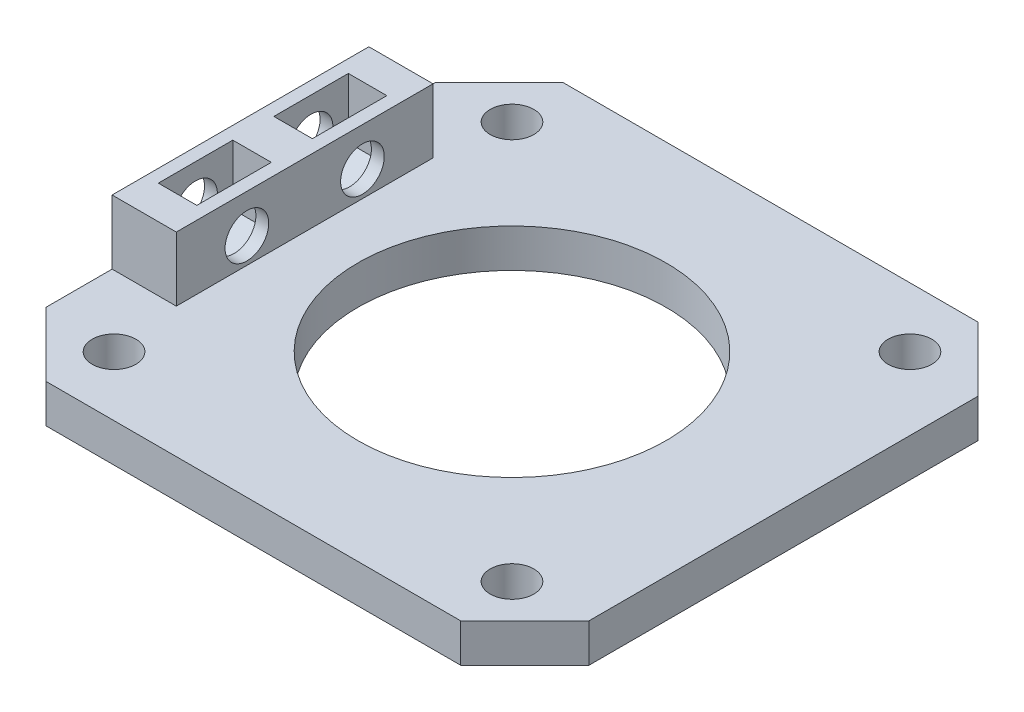
ISO-10303-21;
HEADER;
FILE_DESCRIPTION(('STEP AP214'),'2;1');
FILE_NAME('part.step','',(''),(''),'','','');
FILE_SCHEMA(('AUTOMOTIVE_DESIGN { 1 0 10303 214 1 1 1 1 }'));
ENDSEC;
DATA;
#1=APPLICATION_CONTEXT('core data for automotive mechanical design processes');
#2=APPLICATION_PROTOCOL_DEFINITION('international standard','automotive_design',2000,#1);
#3=PRODUCT_CONTEXT('',#1,'mechanical');
#4=PRODUCT('Part','Part','',(#3));
#5=PRODUCT_RELATED_PRODUCT_CATEGORY('part','',(#4));
#6=PRODUCT_DEFINITION_FORMATION('','',#4);
#7=PRODUCT_DEFINITION_CONTEXT('part definition',#1,'design');
#8=PRODUCT_DEFINITION('design','',#6,#7);
#9=PRODUCT_DEFINITION_SHAPE('','',#8);
#10=(LENGTH_UNIT() NAMED_UNIT(*) SI_UNIT(.MILLI.,.METRE.));
#11=(NAMED_UNIT(*) PLANE_ANGLE_UNIT() SI_UNIT($,.RADIAN.));
#12=(NAMED_UNIT(*) SI_UNIT($,.STERADIAN.) SOLID_ANGLE_UNIT());
#13=UNCERTAINTY_MEASURE_WITH_UNIT(LENGTH_MEASURE(1.E-05),#10,'distance_accuracy_value','');
#14=(GEOMETRIC_REPRESENTATION_CONTEXT(3) GLOBAL_UNCERTAINTY_ASSIGNED_CONTEXT((#13)) GLOBAL_UNIT_ASSIGNED_CONTEXT((#10,
#11,#12)) REPRESENTATION_CONTEXT('',''));
#15=CARTESIAN_POINT('',(0.,0.,0.));
#16=DIRECTION('',(0.,0.,1.));
#17=DIRECTION('',(1.,0.,0.));
#18=AXIS2_PLACEMENT_3D('',#15,#16,#17);
#19=CARTESIAN_POINT('',(0.,8.,0.));
#20=DIRECTION('',(0.,1.,0.));
#21=DIRECTION('',(0.,0.,1.));
#22=AXIS2_PLACEMENT_3D('',#19,#20,#21);
#23=PLANE('',#22);
#24=DIRECTION('',(0.,0.,-1.));
#25=VECTOR('',#24,1.);
#26=CARTESIAN_POINT('',(-17.15,8.,0.));
#27=LINE('',#26,#25);
#28=CARTESIAN_POINT('',(-17.15,8.,7.40118510267787));
#29=VERTEX_POINT('',#28);
#30=CARTESIAN_POINT('',(-17.15,8.,1.59881489732213));
#31=VERTEX_POINT('',#30);
#32=EDGE_CURVE('E273',#29,#31,#27,.T.);
#33=ORIENTED_EDGE('',*,*,#32,.F.);
#34=DIRECTION('',(-1.,0.,0.));
#35=VECTOR('',#34,1.);
#36=CARTESIAN_POINT('',(0.,8.,7.40118510267787));
#37=LINE('',#36,#35);
#38=CARTESIAN_POINT('',(-20.15,8.,7.40118510267787));
#39=VERTEX_POINT('',#38);
#40=EDGE_CURVE('E58',#29,#39,#37,.T.);
#41=ORIENTED_EDGE('',*,*,#40,.T.);
#42=DIRECTION('',(0.,0.,-1.));
#43=VECTOR('',#42,1.);
#44=CARTESIAN_POINT('',(-20.15,8.,0.));
#45=LINE('',#44,#43);
#46=CARTESIAN_POINT('',(-20.15,8.,1.59881489732213));
#47=VERTEX_POINT('',#46);
#48=EDGE_CURVE('E207',#39,#47,#45,.T.);
#49=ORIENTED_EDGE('',*,*,#48,.T.);
#50=DIRECTION('',(1.,0.,0.));
#51=VECTOR('',#50,1.);
#52=CARTESIAN_POINT('',(0.,8.,1.59881489732213));
#53=LINE('',#52,#51);
#54=EDGE_CURVE('E13',#47,#31,#53,.T.);
#55=ORIENTED_EDGE('',*,*,#54,.T.);
#56=EDGE_LOOP('',(#33,#41,#49,#55));
#57=FACE_BOUND('',#56,.T.);
#58=DIRECTION('',(0.,0.,1.));
#59=VECTOR('',#58,1.);
#60=CARTESIAN_POINT('',(-21.15,8.,9.99999999999999));
#61=LINE('',#60,#59);
#62=CARTESIAN_POINT('',(-21.15,8.,-10.));
#63=VERTEX_POINT('',#62);
#64=CARTESIAN_POINT('',(-21.15,8.,9.99999999999999));
#65=VERTEX_POINT('',#64);
#66=EDGE_CURVE('E282',#63,#65,#61,.T.);
#67=ORIENTED_EDGE('',*,*,#66,.T.);
#68=DIRECTION('',(1.,0.,0.));
#69=VECTOR('',#68,1.);
#70=CARTESIAN_POINT('',(-16.15,8.,9.99999999999999));
#71=LINE('',#70,#69);
#72=CARTESIAN_POINT('',(-16.15,8.,9.99999999999999));
#73=VERTEX_POINT('',#72);
#74=EDGE_CURVE('E285',#65,#73,#71,.T.);
#75=ORIENTED_EDGE('',*,*,#74,.T.);
#76=DIRECTION('',(0.,0.,-1.));
#77=VECTOR('',#76,1.);
#78=CARTESIAN_POINT('',(-16.15,8.,9.99999999999999));
#79=LINE('',#78,#77);
#80=CARTESIAN_POINT('',(-16.15,8.,-10.));
#81=VERTEX_POINT('',#80);
#82=EDGE_CURVE('E288',#73,#81,#79,.T.);
#83=ORIENTED_EDGE('',*,*,#82,.T.);
#84=DIRECTION('',(-1.,0.,0.));
#85=VECTOR('',#84,1.);
#86=CARTESIAN_POINT('',(-16.15,8.,-10.));
#87=LINE('',#86,#85);
#88=EDGE_CURVE('E290',#81,#63,#87,.T.);
#89=ORIENTED_EDGE('',*,*,#88,.T.);
#90=EDGE_LOOP('',(#67,#75,#83,#89));
#91=FACE_BOUND('',#90,.T.);
#92=DIRECTION('',(1.,0.,0.));
#93=VECTOR('',#92,1.);
#94=CARTESIAN_POINT('',(0.,8.,-7.40118510267787));
#95=LINE('',#94,#93);
#96=CARTESIAN_POINT('',(-20.15,8.,-7.40118510267787));
#97=VERTEX_POINT('',#96);
#98=CARTESIAN_POINT('',(-17.15,8.,-7.40118510267787));
#99=VERTEX_POINT('',#98);
#100=EDGE_CURVE('E405',#97,#99,#95,.T.);
#101=ORIENTED_EDGE('',*,*,#100,.T.);
#102=DIRECTION('',(0.,0.,1.));
#103=VECTOR('',#102,1.);
#104=CARTESIAN_POINT('',(-17.15,8.,0.));
#105=LINE('',#104,#103);
#106=CARTESIAN_POINT('',(-17.15,8.,-1.59881489732213));
#107=VERTEX_POINT('',#106);
#108=EDGE_CURVE('E267',#99,#107,#105,.T.);
#109=ORIENTED_EDGE('',*,*,#108,.T.);
#110=DIRECTION('',(-1.,0.,0.));
#111=VECTOR('',#110,1.);
#112=CARTESIAN_POINT('',(0.,8.,-1.59881489732213));
#113=LINE('',#112,#111);
#114=CARTESIAN_POINT('',(-20.15,8.,-1.59881489732213));
#115=VERTEX_POINT('',#114);
#116=EDGE_CURVE('E420',#107,#115,#113,.T.);
#117=ORIENTED_EDGE('',*,*,#116,.T.);
#118=DIRECTION('',(0.,0.,1.));
#119=VECTOR('',#118,1.);
#120=CARTESIAN_POINT('',(-20.15,8.,0.));
#121=LINE('',#120,#119);
#122=EDGE_CURVE('E264',#97,#115,#121,.T.);
#123=ORIENTED_EDGE('',*,*,#122,.F.);
#124=EDGE_LOOP('',(#101,#109,#117,#123));
#125=FACE_BOUND('',#124,.T.);
#126=ADVANCED_FACE('F49',(#57,#91,#125),#23,.T.);
#127=CARTESIAN_POINT('',(-14.15,5.,4.5));
#128=DIRECTION('',(-1.,0.,0.));
#129=DIRECTION('',(0.,0.,1.));
#130=AXIS2_PLACEMENT_3D('',#127,#128,#129);
#131=CYLINDRICAL_SURFACE('',#130,1.7);
#132=CARTESIAN_POINT('',(-21.15,5.,4.5));
#133=DIRECTION('',(-1.,0.,0.));
#134=DIRECTION('',(0.,0.,1.));
#135=AXIS2_PLACEMENT_3D('',#132,#133,#134);
#136=CIRCLE('',#135,1.7);
#137=CARTESIAN_POINT('',(-21.15,5.,6.2));
#138=VERTEX_POINT('',#137);
#139=EDGE_CURVE('E275',#138,#138,#136,.T.);
#140=ORIENTED_EDGE('',*,*,#139,.T.);
#141=EDGE_LOOP('',(#140));
#142=FACE_BOUND('',#141,.T.);
#143=CARTESIAN_POINT('',(-20.15,5.,4.5));
#144=DIRECTION('',(1.,0.,0.));
#145=DIRECTION('',(0.,0.,-1.));
#146=AXIS2_PLACEMENT_3D('',#143,#144,#145);
#147=CIRCLE('',#146,1.7);
#148=CARTESIAN_POINT('',(-20.15,5.,2.8));
#149=VERTEX_POINT('',#148);
#150=EDGE_CURVE('E270',#149,#149,#147,.F.);
#151=ORIENTED_EDGE('',*,*,#150,.F.);
#152=EDGE_LOOP('',(#151));
#153=FACE_BOUND('',#152,.T.);
#154=ADVANCED_FACE('F444',(#142,#153),#131,.F.);
#155=CARTESIAN_POINT('',(-14.15,5.,-4.5));
#156=DIRECTION('',(-1.,0.,0.));
#157=DIRECTION('',(0.,0.,1.));
#158=AXIS2_PLACEMENT_3D('',#155,#156,#157);
#159=CYLINDRICAL_SURFACE('',#158,1.7);
#160=CARTESIAN_POINT('',(-16.15,5.,-4.5));
#161=DIRECTION('',(-1.,0.,0.));
#162=DIRECTION('',(0.,0.,1.));
#163=AXIS2_PLACEMENT_3D('',#160,#161,#162);
#164=CIRCLE('',#163,1.7);
#165=CARTESIAN_POINT('',(-16.15,5.,-2.8));
#166=VERTEX_POINT('',#165);
#167=EDGE_CURVE('E297',#166,#166,#164,.T.);
#168=ORIENTED_EDGE('',*,*,#167,.F.);
#169=EDGE_LOOP('',(#168));
#170=FACE_BOUND('',#169,.T.);
#171=CARTESIAN_POINT('',(-17.15,5.,-4.5));
#172=DIRECTION('',(-1.,0.,0.));
#173=DIRECTION('',(0.,0.,1.));
#174=AXIS2_PLACEMENT_3D('',#171,#172,#173);
#175=CIRCLE('',#174,1.7);
#176=CARTESIAN_POINT('',(-17.15,5.,-2.8));
#177=VERTEX_POINT('',#176);
#178=EDGE_CURVE('E266',#177,#177,#175,.F.);
#179=ORIENTED_EDGE('',*,*,#178,.F.);
#180=EDGE_LOOP('',(#179));
#181=FACE_BOUND('',#180,.T.);
#182=ADVANCED_FACE('F449',(#170,#181),#159,.F.);
#183=CARTESIAN_POINT('',(-21.15,3.,-15.15));
#184=DIRECTION('',(0.707106781186547,0.,0.707106781186547));
#185=DIRECTION('',(0.,-1.,0.));
#186=AXIS2_PLACEMENT_3D('',#183,#184,#185);
#187=PLANE('',#186);
#188=DIRECTION('',(0.,-1.,0.));
#189=VECTOR('',#188,1.);
#190=CARTESIAN_POINT('',(-21.15,3.,-15.15));
#191=LINE('',#190,#189);
#192=CARTESIAN_POINT('',(-21.15,3.,-15.15));
#193=VERTEX_POINT('',#192);
#194=CARTESIAN_POINT('',(-21.15,0.,-15.15));
#195=VERTEX_POINT('',#194);
#196=EDGE_CURVE('E395',#193,#195,#191,.T.);
#197=ORIENTED_EDGE('',*,*,#196,.F.);
#198=DIRECTION('',(0.707106781186548,0.,-0.707106781186548));
#199=VECTOR('',#198,1.);
#200=CARTESIAN_POINT('',(-18.15,3.,-18.15));
#201=LINE('',#200,#199);
#202=CARTESIAN_POINT('',(-16.15,3.,-20.15));
#203=VERTEX_POINT('',#202);
#204=EDGE_CURVE('E401',#203,#193,#201,.F.);
#205=ORIENTED_EDGE('',*,*,#204,.F.);
#206=DIRECTION('',(0.,1.,0.));
#207=VECTOR('',#206,1.);
#208=CARTESIAN_POINT('',(-16.15,3.,-20.15));
#209=LINE('',#208,#207);
#210=CARTESIAN_POINT('',(-16.15,0.,-20.15));
#211=VERTEX_POINT('',#210);
#212=EDGE_CURVE('E398',#211,#203,#209,.T.);
#213=ORIENTED_EDGE('',*,*,#212,.F.);
#214=DIRECTION('',(-0.707106781186548,0.,0.707106781186548));
#215=VECTOR('',#214,1.);
#216=CARTESIAN_POINT('',(-21.15,0.,-15.15));
#217=LINE('',#216,#215);
#218=EDGE_CURVE('E403',#195,#211,#217,.F.);
#219=ORIENTED_EDGE('',*,*,#218,.F.);
#220=EDGE_LOOP('',(#197,#205,#213,#219));
#221=FACE_BOUND('',#220,.T.);
#222=ADVANCED_FACE('F52',(#221),#187,.F.);
#223=CARTESIAN_POINT('',(-21.15,3.,15.15));
#224=DIRECTION('',(0.707106781186547,0.,-0.707106781186548));
#225=DIRECTION('',(0.,1.,0.));
#226=AXIS2_PLACEMENT_3D('',#223,#224,#225);
#227=PLANE('',#226);
#228=DIRECTION('',(0.,1.,0.));
#229=VECTOR('',#228,1.);
#230=CARTESIAN_POINT('',(-21.15,3.,15.15));
#231=LINE('',#230,#229);
#232=CARTESIAN_POINT('',(-21.15,0.,15.15));
#233=VERTEX_POINT('',#232);
#234=CARTESIAN_POINT('',(-21.15,3.,15.15));
#235=VERTEX_POINT('',#234);
#236=EDGE_CURVE('E384',#233,#235,#231,.T.);
#237=ORIENTED_EDGE('',*,*,#236,.F.);
#238=DIRECTION('',(0.707106781186548,0.,0.707106781186547));
#239=VECTOR('',#238,1.);
#240=CARTESIAN_POINT('',(-21.15,0.,15.15));
#241=LINE('',#240,#239);
#242=CARTESIAN_POINT('',(-16.15,0.,20.15));
#243=VERTEX_POINT('',#242);
#244=EDGE_CURVE('E390',#243,#233,#241,.F.);
#245=ORIENTED_EDGE('',*,*,#244,.F.);
#246=DIRECTION('',(0.,-1.,0.));
#247=VECTOR('',#246,1.);
#248=CARTESIAN_POINT('',(-16.15,3.,20.15));
#249=LINE('',#248,#247);
#250=CARTESIAN_POINT('',(-16.15,3.,20.15));
#251=VERTEX_POINT('',#250);
#252=EDGE_CURVE('E387',#251,#243,#249,.T.);
#253=ORIENTED_EDGE('',*,*,#252,.F.);
#254=DIRECTION('',(-0.707106781186548,0.,-0.707106781186547));
#255=VECTOR('',#254,1.);
#256=CARTESIAN_POINT('',(-18.15,3.,18.15));
#257=LINE('',#256,#255);
#258=EDGE_CURVE('E393',#235,#251,#257,.F.);
#259=ORIENTED_EDGE('',*,*,#258,.F.);
#260=EDGE_LOOP('',(#237,#245,#253,#259));
#261=FACE_BOUND('',#260,.T.);
#262=ADVANCED_FACE('F524',(#261),#227,.F.);
#263=CARTESIAN_POINT('',(16.15,3.,20.15));
#264=DIRECTION('',(-0.707106781186548,0.,-0.707106781186548));
#265=DIRECTION('',(0.,1.,0.));
#266=AXIS2_PLACEMENT_3D('',#263,#264,#265);
#267=PLANE('',#266);
#268=DIRECTION('',(0.,1.,0.));
#269=VECTOR('',#268,1.);
#270=CARTESIAN_POINT('',(16.15,3.,20.15));
#271=LINE('',#270,#269);
#272=CARTESIAN_POINT('',(16.15,0.,20.15));
#273=VERTEX_POINT('',#272);
#274=CARTESIAN_POINT('',(16.15,3.,20.15));
#275=VERTEX_POINT('',#274);
#276=EDGE_CURVE('E373',#273,#275,#271,.T.);
#277=ORIENTED_EDGE('',*,*,#276,.F.);
#278=DIRECTION('',(0.707106781186548,0.,-0.707106781186548));
#279=VECTOR('',#278,1.);
#280=CARTESIAN_POINT('',(16.15,0.,20.15));
#281=LINE('',#280,#279);
#282=CARTESIAN_POINT('',(21.15,0.,15.15));
#283=VERTEX_POINT('',#282);
#284=EDGE_CURVE('E379',#283,#273,#281,.F.);
#285=ORIENTED_EDGE('',*,*,#284,.F.);
#286=DIRECTION('',(0.,-1.,0.));
#287=VECTOR('',#286,1.);
#288=CARTESIAN_POINT('',(21.15,3.,15.15));
#289=LINE('',#288,#287);
#290=CARTESIAN_POINT('',(21.15,3.,15.15));
#291=VERTEX_POINT('',#290);
#292=EDGE_CURVE('E376',#291,#283,#289,.T.);
#293=ORIENTED_EDGE('',*,*,#292,.F.);
#294=DIRECTION('',(-0.707106781186548,0.,0.707106781186548));
#295=VECTOR('',#294,1.);
#296=CARTESIAN_POINT('',(18.15,3.,18.15));
#297=LINE('',#296,#295);
#298=EDGE_CURVE('E382',#275,#291,#297,.F.);
#299=ORIENTED_EDGE('',*,*,#298,.F.);
#300=EDGE_LOOP('',(#277,#285,#293,#299));
#301=FACE_BOUND('',#300,.T.);
#302=ADVANCED_FACE('F518',(#301),#267,.F.);
#303=CARTESIAN_POINT('',(16.15,3.,-20.15));
#304=DIRECTION('',(-0.707106781186547,0.,0.707106781186547));
#305=DIRECTION('',(0.,-1.,0.));
#306=AXIS2_PLACEMENT_3D('',#303,#304,#305);
#307=PLANE('',#306);
#308=DIRECTION('',(0.,-1.,0.));
#309=VECTOR('',#308,1.);
#310=CARTESIAN_POINT('',(16.15,3.,-20.15));
#311=LINE('',#310,#309);
#312=CARTESIAN_POINT('',(16.15,3.,-20.15));
#313=VERTEX_POINT('',#312);
#314=CARTESIAN_POINT('',(16.15,0.,-20.15));
#315=VERTEX_POINT('',#314);
#316=EDGE_CURVE('E354',#313,#315,#311,.T.);
#317=ORIENTED_EDGE('',*,*,#316,.F.);
#318=DIRECTION('',(0.707106781186548,0.,0.707106781186548));
#319=VECTOR('',#318,1.);
#320=CARTESIAN_POINT('',(18.15,3.,-18.15));
#321=LINE('',#320,#319);
#322=CARTESIAN_POINT('',(21.15,3.,-15.15));
#323=VERTEX_POINT('',#322);
#324=EDGE_CURVE('E368',#323,#313,#321,.F.);
#325=ORIENTED_EDGE('',*,*,#324,.F.);
#326=DIRECTION('',(0.,1.,0.));
#327=VECTOR('',#326,1.);
#328=CARTESIAN_POINT('',(21.15,3.,-15.15));
#329=LINE('',#328,#327);
#330=CARTESIAN_POINT('',(21.15,0.,-15.15));
#331=VERTEX_POINT('',#330);
#332=EDGE_CURVE('E365',#331,#323,#329,.T.);
#333=ORIENTED_EDGE('',*,*,#332,.F.);
#334=DIRECTION('',(-0.707106781186548,0.,-0.707106781186548));
#335=VECTOR('',#334,1.);
#336=CARTESIAN_POINT('',(16.15,0.,-20.15));
#337=LINE('',#336,#335);
#338=EDGE_CURVE('E370',#315,#331,#337,.F.);
#339=ORIENTED_EDGE('',*,*,#338,.F.);
#340=EDGE_LOOP('',(#317,#325,#333,#339));
#341=FACE_BOUND('',#340,.T.);
#342=ADVANCED_FACE('F492',(#341),#307,.F.);
#343=CARTESIAN_POINT('',(0.,3.,0.));
#344=DIRECTION('',(0.,1.,0.));
#345=DIRECTION('',(0.,0.,1.));
#346=AXIS2_PLACEMENT_3D('',#343,#344,#345);
#347=PLANE('',#346);
#348=DIRECTION('',(-1.,0.,0.));
#349=VECTOR('',#348,1.);
#350=CARTESIAN_POINT('',(-16.15,3.,-10.));
#351=LINE('',#350,#349);
#352=CARTESIAN_POINT('',(-16.15,3.,-10.));
#353=VERTEX_POINT('',#352);
#354=CARTESIAN_POINT('',(-21.15,3.,-10.));
#355=VERTEX_POINT('',#354);
#356=EDGE_CURVE('E286',#353,#355,#351,.T.);
#357=ORIENTED_EDGE('',*,*,#356,.F.);
#358=DIRECTION('',(0.,0.,-1.));
#359=VECTOR('',#358,1.);
#360=CARTESIAN_POINT('',(-16.15,3.,9.99999999999999));
#361=LINE('',#360,#359);
#362=CARTESIAN_POINT('',(-16.15,3.,9.99999999999999));
#363=VERTEX_POINT('',#362);
#364=EDGE_CURVE('E296',#363,#353,#361,.T.);
#365=ORIENTED_EDGE('',*,*,#364,.F.);
#366=DIRECTION('',(1.,0.,0.));
#367=VECTOR('',#366,1.);
#368=CARTESIAN_POINT('',(-16.15,3.,9.99999999999999));
#369=LINE('',#368,#367);
#370=CARTESIAN_POINT('',(-21.15,3.,9.99999999999999));
#371=VERTEX_POINT('',#370);
#372=EDGE_CURVE('E293',#371,#363,#369,.T.);
#373=ORIENTED_EDGE('',*,*,#372,.F.);
#374=DIRECTION('',(0.,0.,1.));
#375=VECTOR('',#374,1.);
#376=CARTESIAN_POINT('',(-21.15,3.,20.15));
#377=LINE('',#376,#375);
#378=EDGE_CURVE('E347',#371,#235,#377,.T.);
#379=ORIENTED_EDGE('',*,*,#378,.T.);
#380=ORIENTED_EDGE('',*,*,#258,.T.);
#381=DIRECTION('',(1.,0.,0.));
#382=VECTOR('',#381,1.);
#383=CARTESIAN_POINT('',(21.15,3.,20.15));
#384=LINE('',#383,#382);
#385=EDGE_CURVE('E346',#251,#275,#384,.T.);
#386=ORIENTED_EDGE('',*,*,#385,.T.);
#387=ORIENTED_EDGE('',*,*,#298,.T.);
#388=DIRECTION('',(0.,0.,-1.));
#389=VECTOR('',#388,1.);
#390=CARTESIAN_POINT('',(21.15,3.,20.15));
#391=LINE('',#390,#389);
#392=EDGE_CURVE('E349',#291,#323,#391,.T.);
#393=ORIENTED_EDGE('',*,*,#392,.T.);
#394=ORIENTED_EDGE('',*,*,#324,.T.);
#395=DIRECTION('',(-1.,0.,0.));
#396=VECTOR('',#395,1.);
#397=CARTESIAN_POINT('',(21.15,3.,-20.15));
#398=LINE('',#397,#396);
#399=EDGE_CURVE('E351',#313,#203,#398,.T.);
#400=ORIENTED_EDGE('',*,*,#399,.T.);
#401=ORIENTED_EDGE('',*,*,#204,.T.);
#402=EDGE_CURVE('E344',#193,#355,#377,.T.);
#403=ORIENTED_EDGE('',*,*,#402,.T.);
#404=EDGE_LOOP('',(#357,#365,#373,#379,#380,#386,#387,#393,#394,#400,#401,#403));
#405=FACE_BOUND('',#404,.T.);
#406=CARTESIAN_POINT('',(-15.5,3.,15.5));
#407=DIRECTION('',(0.,1.,0.));
#408=DIRECTION('',(0.,0.,1.));
#409=AXIS2_PLACEMENT_3D('',#406,#407,#408);
#410=CIRCLE('',#409,1.7);
#411=CARTESIAN_POINT('',(-15.5,3.,17.2));
#412=VERTEX_POINT('',#411);
#413=EDGE_CURVE('E320',#412,#412,#410,.T.);
#414=ORIENTED_EDGE('',*,*,#413,.F.);
#415=EDGE_LOOP('',(#414));
#416=FACE_BOUND('',#415,.T.);
#417=CARTESIAN_POINT('',(-15.5,3.,-15.5));
#418=DIRECTION('',(0.,1.,0.));
#419=DIRECTION('',(0.,0.,1.));
#420=AXIS2_PLACEMENT_3D('',#417,#418,#419);
#421=CIRCLE('',#420,1.7);
#422=CARTESIAN_POINT('',(-15.5,3.,-13.8));
#423=VERTEX_POINT('',#422);
#424=EDGE_CURVE('E332',#423,#423,#421,.T.);
#425=ORIENTED_EDGE('',*,*,#424,.F.);
#426=EDGE_LOOP('',(#425));
#427=FACE_BOUND('',#426,.T.);
#428=CARTESIAN_POINT('',(0.,3.,0.));
#429=DIRECTION('',(0.,1.,0.));
#430=DIRECTION('',(0.,0.,1.));
#431=AXIS2_PLACEMENT_3D('',#428,#429,#430);
#432=CIRCLE('',#431,12.);
#433=CARTESIAN_POINT('',(0.,3.,12.));
#434=VERTEX_POINT('',#433);
#435=EDGE_CURVE('E338',#434,#434,#432,.T.);
#436=ORIENTED_EDGE('',*,*,#435,.F.);
#437=EDGE_LOOP('',(#436));
#438=FACE_BOUND('',#437,.T.);
#439=CARTESIAN_POINT('',(15.5,3.,-15.5));
#440=DIRECTION('',(0.,1.,0.));
#441=DIRECTION('',(0.,0.,1.));
#442=AXIS2_PLACEMENT_3D('',#439,#440,#441);
#443=CIRCLE('',#442,1.7);
#444=CARTESIAN_POINT('',(15.5,3.,-13.8));
#445=VERTEX_POINT('',#444);
#446=EDGE_CURVE('E326',#445,#445,#443,.T.);
#447=ORIENTED_EDGE('',*,*,#446,.F.);
#448=EDGE_LOOP('',(#447));
#449=FACE_BOUND('',#448,.T.);
#450=CARTESIAN_POINT('',(15.5,3.,15.5));
#451=DIRECTION('',(0.,1.,0.));
#452=DIRECTION('',(0.,0.,1.));
#453=AXIS2_PLACEMENT_3D('',#450,#451,#452);
#454=CIRCLE('',#453,1.7);
#455=CARTESIAN_POINT('',(15.5,3.,17.2));
#456=VERTEX_POINT('',#455);
#457=EDGE_CURVE('E314',#456,#456,#454,.T.);
#458=ORIENTED_EDGE('',*,*,#457,.F.);
#459=EDGE_LOOP('',(#458));
#460=FACE_BOUND('',#459,.T.);
#461=ADVANCED_FACE('F488',(#405,#416,#427,#438,#449,#460),#347,.T.);
#462=CARTESIAN_POINT('',(0.,0.,0.));
#463=DIRECTION('',(0.,1.,0.));
#464=DIRECTION('',(0.,0.,1.));
#465=AXIS2_PLACEMENT_3D('',#462,#463,#464);
#466=PLANE('',#465);
#467=DIRECTION('',(0.,0.,1.));
#468=VECTOR('',#467,1.);
#469=CARTESIAN_POINT('',(-21.15,0.,20.15));
#470=LINE('',#469,#468);
#471=EDGE_CURVE('E341',#195,#233,#470,.T.);
#472=ORIENTED_EDGE('',*,*,#471,.F.);
#473=ORIENTED_EDGE('',*,*,#218,.T.);
#474=DIRECTION('',(-1.,0.,0.));
#475=VECTOR('',#474,1.);
#476=CARTESIAN_POINT('',(21.15,0.,-20.15));
#477=LINE('',#476,#475);
#478=EDGE_CURVE('E360',#315,#211,#477,.T.);
#479=ORIENTED_EDGE('',*,*,#478,.F.);
#480=ORIENTED_EDGE('',*,*,#338,.T.);
#481=DIRECTION('',(0.,0.,-1.));
#482=VECTOR('',#481,1.);
#483=CARTESIAN_POINT('',(21.15,0.,20.15));
#484=LINE('',#483,#482);
#485=EDGE_CURVE('E358',#283,#331,#484,.T.);
#486=ORIENTED_EDGE('',*,*,#485,.F.);
#487=ORIENTED_EDGE('',*,*,#284,.T.);
#488=DIRECTION('',(1.,0.,0.));
#489=VECTOR('',#488,1.);
#490=CARTESIAN_POINT('',(21.15,0.,20.15));
#491=LINE('',#490,#489);
#492=EDGE_CURVE('E356',#243,#273,#491,.T.);
#493=ORIENTED_EDGE('',*,*,#492,.F.);
#494=ORIENTED_EDGE('',*,*,#244,.T.);
#495=EDGE_LOOP('',(#472,#473,#479,#480,#486,#487,#493,#494));
#496=FACE_BOUND('',#495,.T.);
#497=CARTESIAN_POINT('',(0.,0.,0.));
#498=DIRECTION('',(0.,1.,0.));
#499=DIRECTION('',(0.,0.,1.));
#500=AXIS2_PLACEMENT_3D('',#497,#498,#499);
#501=CIRCLE('',#500,12.);
#502=CARTESIAN_POINT('',(0.,0.,12.));
#503=VERTEX_POINT('',#502);
#504=EDGE_CURVE('E335',#503,#503,#501,.T.);
#505=ORIENTED_EDGE('',*,*,#504,.T.);
#506=EDGE_LOOP('',(#505));
#507=FACE_BOUND('',#506,.T.);
#508=CARTESIAN_POINT('',(-15.5,0.,-15.5));
#509=DIRECTION('',(0.,1.,0.));
#510=DIRECTION('',(0.,0.,1.));
#511=AXIS2_PLACEMENT_3D('',#508,#509,#510);
#512=CIRCLE('',#511,1.7);
#513=CARTESIAN_POINT('',(-15.5,0.,-13.8));
#514=VERTEX_POINT('',#513);
#515=EDGE_CURVE('E329',#514,#514,#512,.T.);
#516=ORIENTED_EDGE('',*,*,#515,.T.);
#517=EDGE_LOOP('',(#516));
#518=FACE_BOUND('',#517,.T.);
#519=CARTESIAN_POINT('',(15.5,0.,-15.5));
#520=DIRECTION('',(0.,1.,0.));
#521=DIRECTION('',(0.,0.,1.));
#522=AXIS2_PLACEMENT_3D('',#519,#520,#521);
#523=CIRCLE('',#522,1.7);
#524=CARTESIAN_POINT('',(15.5,0.,-13.8));
#525=VERTEX_POINT('',#524);
#526=EDGE_CURVE('E323',#525,#525,#523,.T.);
#527=ORIENTED_EDGE('',*,*,#526,.T.);
#528=EDGE_LOOP('',(#527));
#529=FACE_BOUND('',#528,.T.);
#530=CARTESIAN_POINT('',(-15.5,0.,15.5));
#531=DIRECTION('',(0.,1.,0.));
#532=DIRECTION('',(0.,0.,1.));
#533=AXIS2_PLACEMENT_3D('',#530,#531,#532);
#534=CIRCLE('',#533,1.7);
#535=CARTESIAN_POINT('',(-15.5,0.,17.2));
#536=VERTEX_POINT('',#535);
#537=EDGE_CURVE('E317',#536,#536,#534,.T.);
#538=ORIENTED_EDGE('',*,*,#537,.T.);
#539=EDGE_LOOP('',(#538));
#540=FACE_BOUND('',#539,.T.);
#541=CARTESIAN_POINT('',(15.5,0.,15.5));
#542=DIRECTION('',(0.,1.,0.));
#543=DIRECTION('',(0.,0.,1.));
#544=AXIS2_PLACEMENT_3D('',#541,#542,#543);
#545=CIRCLE('',#544,1.7);
#546=CARTESIAN_POINT('',(15.5,0.,17.2));
#547=VERTEX_POINT('',#546);
#548=EDGE_CURVE('E313',#547,#547,#545,.T.);
#549=ORIENTED_EDGE('',*,*,#548,.T.);
#550=EDGE_LOOP('',(#549));
#551=FACE_BOUND('',#550,.T.);
#552=ADVANCED_FACE('F491',(#496,#507,#518,#529,#540,#551),#466,.F.);
#553=CARTESIAN_POINT('',(-21.15,3.,20.15));
#554=DIRECTION('',(1.,0.,0.));
#555=DIRECTION('',(0.,0.,-1.));
#556=AXIS2_PLACEMENT_3D('',#553,#554,#555);
#557=PLANE('',#556);
#558=CARTESIAN_POINT('',(-21.15,5.,-4.5));
#559=DIRECTION('',(-1.,0.,0.));
#560=DIRECTION('',(0.,0.,1.));
#561=AXIS2_PLACEMENT_3D('',#558,#559,#560);
#562=CIRCLE('',#561,1.7);
#563=CARTESIAN_POINT('',(-21.15,5.,-2.8));
#564=VERTEX_POINT('',#563);
#565=EDGE_CURVE('E276',#564,#564,#562,.T.);
#566=ORIENTED_EDGE('',*,*,#565,.F.);
#567=EDGE_LOOP('',(#566));
#568=FACE_BOUND('',#567,.T.);
#569=ORIENTED_EDGE('',*,*,#139,.F.);
#570=EDGE_LOOP('',(#569));
#571=FACE_BOUND('',#570,.T.);
#572=ORIENTED_EDGE('',*,*,#402,.F.);
#573=ORIENTED_EDGE('',*,*,#196,.T.);
#574=ORIENTED_EDGE('',*,*,#471,.T.);
#575=ORIENTED_EDGE('',*,*,#236,.T.);
#576=ORIENTED_EDGE('',*,*,#378,.F.);
#577=DIRECTION('',(0.,-1.,0.));
#578=VECTOR('',#577,1.);
#579=CARTESIAN_POINT('',(-21.15,8.,9.99999999999999));
#580=LINE('',#579,#578);
#581=EDGE_CURVE('E310',#65,#371,#580,.T.);
#582=ORIENTED_EDGE('',*,*,#581,.F.);
#583=ORIENTED_EDGE('',*,*,#66,.F.);
#584=DIRECTION('',(0.,-1.,0.));
#585=VECTOR('',#584,1.);
#586=CARTESIAN_POINT('',(-21.15,8.,-10.));
#587=LINE('',#586,#585);
#588=EDGE_CURVE('E292',#63,#355,#587,.T.);
#589=ORIENTED_EDGE('',*,*,#588,.T.);
#590=EDGE_LOOP('',(#572,#573,#574,#575,#576,#582,#583,#589));
#591=FACE_BOUND('',#590,.T.);
#592=ADVANCED_FACE('F496',(#568,#571,#591),#557,.F.);
#593=CARTESIAN_POINT('',(21.15,3.,20.15));
#594=DIRECTION('',(0.,0.,-1.));
#595=DIRECTION('',(-1.,0.,0.));
#596=AXIS2_PLACEMENT_3D('',#593,#594,#595);
#597=PLANE('',#596);
#598=ORIENTED_EDGE('',*,*,#385,.F.);
#599=ORIENTED_EDGE('',*,*,#252,.T.);
#600=ORIENTED_EDGE('',*,*,#492,.T.);
#601=ORIENTED_EDGE('',*,*,#276,.T.);
#602=EDGE_LOOP('',(#598,#599,#600,#601));
#603=FACE_BOUND('',#602,.T.);
#604=ADVANCED_FACE('F504',(#603),#597,.F.);
#605=CARTESIAN_POINT('',(21.15,3.,20.15));
#606=DIRECTION('',(-1.,0.,0.));
#607=DIRECTION('',(0.,0.,1.));
#608=AXIS2_PLACEMENT_3D('',#605,#606,#607);
#609=PLANE('',#608);
#610=ORIENTED_EDGE('',*,*,#392,.F.);
#611=ORIENTED_EDGE('',*,*,#292,.T.);
#612=ORIENTED_EDGE('',*,*,#485,.T.);
#613=ORIENTED_EDGE('',*,*,#332,.T.);
#614=EDGE_LOOP('',(#610,#611,#612,#613));
#615=FACE_BOUND('',#614,.T.);
#616=ADVANCED_FACE('F500',(#615),#609,.F.);
#617=CARTESIAN_POINT('',(21.15,3.,-20.15));
#618=DIRECTION('',(0.,0.,1.));
#619=DIRECTION('',(1.,0.,0.));
#620=AXIS2_PLACEMENT_3D('',#617,#618,#619);
#621=PLANE('',#620);
#622=ORIENTED_EDGE('',*,*,#478,.T.);
#623=ORIENTED_EDGE('',*,*,#212,.T.);
#624=ORIENTED_EDGE('',*,*,#399,.F.);
#625=ORIENTED_EDGE('',*,*,#316,.T.);
#626=EDGE_LOOP('',(#622,#623,#624,#625));
#627=FACE_BOUND('',#626,.T.);
#628=ADVANCED_FACE('F486',(#627),#621,.F.);
#629=CARTESIAN_POINT('',(0.,3.,0.));
#630=DIRECTION('',(0.,-1.,0.));
#631=DIRECTION('',(0.,0.,-1.));
#632=AXIS2_PLACEMENT_3D('',#629,#630,#631);
#633=CYLINDRICAL_SURFACE('',#632,12.);
#634=ORIENTED_EDGE('',*,*,#435,.T.);
#635=EDGE_LOOP('',(#634));
#636=FACE_BOUND('',#635,.T.);
#637=ORIENTED_EDGE('',*,*,#504,.F.);
#638=EDGE_LOOP('',(#637));
#639=FACE_BOUND('',#638,.T.);
#640=ADVANCED_FACE('F482',(#636,#639),#633,.F.);
#641=CARTESIAN_POINT('',(-15.5,3.,-15.5));
#642=DIRECTION('',(0.,-1.,0.));
#643=DIRECTION('',(0.,0.,-1.));
#644=AXIS2_PLACEMENT_3D('',#641,#642,#643);
#645=CYLINDRICAL_SURFACE('',#644,1.7);
#646=ORIENTED_EDGE('',*,*,#424,.T.);
#647=EDGE_LOOP('',(#646));
#648=FACE_BOUND('',#647,.T.);
#649=ORIENTED_EDGE('',*,*,#515,.F.);
#650=EDGE_LOOP('',(#649));
#651=FACE_BOUND('',#650,.T.);
#652=ADVANCED_FACE('F478',(#648,#651),#645,.F.);
#653=CARTESIAN_POINT('',(15.5,3.,-15.5));
#654=DIRECTION('',(0.,-1.,0.));
#655=DIRECTION('',(0.,0.,-1.));
#656=AXIS2_PLACEMENT_3D('',#653,#654,#655);
#657=CYLINDRICAL_SURFACE('',#656,1.7);
#658=ORIENTED_EDGE('',*,*,#446,.T.);
#659=EDGE_LOOP('',(#658));
#660=FACE_BOUND('',#659,.T.);
#661=ORIENTED_EDGE('',*,*,#526,.F.);
#662=EDGE_LOOP('',(#661));
#663=FACE_BOUND('',#662,.T.);
#664=ADVANCED_FACE('F474',(#660,#663),#657,.F.);
#665=CARTESIAN_POINT('',(-15.5,3.,15.5));
#666=DIRECTION('',(0.,-1.,0.));
#667=DIRECTION('',(0.,0.,-1.));
#668=AXIS2_PLACEMENT_3D('',#665,#666,#667);
#669=CYLINDRICAL_SURFACE('',#668,1.7);
#670=ORIENTED_EDGE('',*,*,#413,.T.);
#671=EDGE_LOOP('',(#670));
#672=FACE_BOUND('',#671,.T.);
#673=ORIENTED_EDGE('',*,*,#537,.F.);
#674=EDGE_LOOP('',(#673));
#675=FACE_BOUND('',#674,.T.);
#676=ADVANCED_FACE('F470',(#672,#675),#669,.F.);
#677=CARTESIAN_POINT('',(15.5,3.,15.5));
#678=DIRECTION('',(0.,-1.,0.));
#679=DIRECTION('',(0.,0.,-1.));
#680=AXIS2_PLACEMENT_3D('',#677,#678,#679);
#681=CYLINDRICAL_SURFACE('',#680,1.7);
#682=ORIENTED_EDGE('',*,*,#457,.T.);
#683=EDGE_LOOP('',(#682));
#684=FACE_BOUND('',#683,.T.);
#685=ORIENTED_EDGE('',*,*,#548,.F.);
#686=EDGE_LOOP('',(#685));
#687=FACE_BOUND('',#686,.T.);
#688=ADVANCED_FACE('F466',(#684,#687),#681,.F.);
#689=CARTESIAN_POINT('',(-16.15,8.,9.99999999999999));
#690=DIRECTION('',(0.,0.,-1.));
#691=DIRECTION('',(-1.,0.,0.));
#692=AXIS2_PLACEMENT_3D('',#689,#690,#691);
#693=PLANE('',#692);
#694=ORIENTED_EDGE('',*,*,#372,.T.);
#695=DIRECTION('',(0.,-1.,0.));
#696=VECTOR('',#695,1.);
#697=CARTESIAN_POINT('',(-16.15,8.,9.99999999999999));
#698=LINE('',#697,#696);
#699=EDGE_CURVE('E307',#73,#363,#698,.T.);
#700=ORIENTED_EDGE('',*,*,#699,.F.);
#701=ORIENTED_EDGE('',*,*,#74,.F.);
#702=ORIENTED_EDGE('',*,*,#581,.T.);
#703=EDGE_LOOP('',(#694,#700,#701,#702));
#704=FACE_BOUND('',#703,.T.);
#705=ADVANCED_FACE('F462',(#704),#693,.F.);
#706=CARTESIAN_POINT('',(-16.15,8.,9.99999999999999));
#707=DIRECTION('',(-1.,0.,0.));
#708=DIRECTION('',(0.,0.,1.));
#709=AXIS2_PLACEMENT_3D('',#706,#707,#708);
#710=PLANE('',#709);
#711=ORIENTED_EDGE('',*,*,#167,.T.);
#712=EDGE_LOOP('',(#711));
#713=FACE_BOUND('',#712,.T.);
#714=CARTESIAN_POINT('',(-16.15,5.,4.5));
#715=DIRECTION('',(-1.,0.,0.));
#716=DIRECTION('',(0.,0.,1.));
#717=AXIS2_PLACEMENT_3D('',#714,#715,#716);
#718=CIRCLE('',#717,1.7);
#719=CARTESIAN_POINT('',(-16.15,5.,6.2));
#720=VERTEX_POINT('',#719);
#721=EDGE_CURVE('E279',#720,#720,#718,.T.);
#722=ORIENTED_EDGE('',*,*,#721,.T.);
#723=EDGE_LOOP('',(#722));
#724=FACE_BOUND('',#723,.T.);
#725=ORIENTED_EDGE('',*,*,#364,.T.);
#726=DIRECTION('',(0.,-1.,0.));
#727=VECTOR('',#726,1.);
#728=CARTESIAN_POINT('',(-16.15,8.,-10.));
#729=LINE('',#728,#727);
#730=EDGE_CURVE('E304',#81,#353,#729,.T.);
#731=ORIENTED_EDGE('',*,*,#730,.F.);
#732=ORIENTED_EDGE('',*,*,#82,.F.);
#733=ORIENTED_EDGE('',*,*,#699,.T.);
#734=EDGE_LOOP('',(#725,#731,#732,#733));
#735=FACE_BOUND('',#734,.T.);
#736=ADVANCED_FACE('F458',(#713,#724,#735),#710,.F.);
#737=CARTESIAN_POINT('',(-16.15,8.,-10.));
#738=DIRECTION('',(0.,0.,1.));
#739=DIRECTION('',(1.,0.,0.));
#740=AXIS2_PLACEMENT_3D('',#737,#738,#739);
#741=PLANE('',#740);
#742=ORIENTED_EDGE('',*,*,#356,.T.);
#743=ORIENTED_EDGE('',*,*,#588,.F.);
#744=ORIENTED_EDGE('',*,*,#88,.F.);
#745=ORIENTED_EDGE('',*,*,#730,.T.);
#746=EDGE_LOOP('',(#742,#743,#744,#745));
#747=FACE_BOUND('',#746,.T.);
#748=ADVANCED_FACE('F455',(#747),#741,.F.);
#749=CARTESIAN_POINT('',(-17.15,5.,4.5));
#750=DIRECTION('',(1.,0.,0.));
#751=DIRECTION('',(0.,0.,-1.));
#752=AXIS2_PLACEMENT_3D('',#749,#750,#751);
#753=CIRCLE('',#752,1.7);
#754=CARTESIAN_POINT('',(-17.15,5.,2.8));
#755=VERTEX_POINT('',#754);
#756=EDGE_CURVE('E272',#755,#755,#753,.F.);
#757=ORIENTED_EDGE('',*,*,#756,.T.);
#758=EDGE_LOOP('',(#757));
#759=FACE_BOUND('',#758,.T.);
#760=ORIENTED_EDGE('',*,*,#721,.F.);
#761=EDGE_LOOP('',(#760));
#762=FACE_BOUND('',#761,.T.);
#763=ADVANCED_FACE('F452',(#759,#762),#131,.F.);
#764=CARTESIAN_POINT('',(-20.15,5.,-4.5));
#765=DIRECTION('',(-1.,0.,0.));
#766=DIRECTION('',(0.,0.,1.));
#767=AXIS2_PLACEMENT_3D('',#764,#765,#766);
#768=CIRCLE('',#767,1.7);
#769=CARTESIAN_POINT('',(-20.15,5.,-2.8));
#770=VERTEX_POINT('',#769);
#771=EDGE_CURVE('E219',#770,#770,#768,.F.);
#772=ORIENTED_EDGE('',*,*,#771,.T.);
#773=EDGE_LOOP('',(#772));
#774=FACE_BOUND('',#773,.T.);
#775=ORIENTED_EDGE('',*,*,#565,.T.);
#776=EDGE_LOOP('',(#775));
#777=FACE_BOUND('',#776,.T.);
#778=ADVANCED_FACE('F601',(#774,#777),#159,.F.);
#779=CARTESIAN_POINT('',(-17.15,0.,0.));
#780=DIRECTION('',(-1.,0.,0.));
#781=DIRECTION('',(0.,0.,1.));
#782=AXIS2_PLACEMENT_3D('',#779,#780,#781);
#783=PLANE('',#782);
#784=DIRECTION('',(0.,1.,0.));
#785=VECTOR('',#784,1.);
#786=CARTESIAN_POINT('',(-17.15,3.325,-7.40118510267787));
#787=LINE('',#786,#785);
#788=CARTESIAN_POINT('',(-17.15,3.325,-7.40118510267787));
#789=VERTEX_POINT('',#788);
#790=EDGE_CURVE('E255',#789,#99,#787,.T.);
#791=ORIENTED_EDGE('',*,*,#790,.F.);
#792=DIRECTION('',(0.,0.5,-0.866025403784439));
#793=VECTOR('',#792,1.);
#794=CARTESIAN_POINT('',(-17.15,1.65,-4.5));
#795=LINE('',#794,#793);
#796=CARTESIAN_POINT('',(-17.15,1.65,-4.5));
#797=VERTEX_POINT('',#796);
#798=EDGE_CURVE('E253',#797,#789,#795,.T.);
#799=ORIENTED_EDGE('',*,*,#798,.F.);
#800=DIRECTION('',(0.,-0.5,-0.866025403784439));
#801=VECTOR('',#800,1.);
#802=CARTESIAN_POINT('',(-17.15,3.325,-1.59881489732213));
#803=LINE('',#802,#801);
#804=CARTESIAN_POINT('',(-17.15,3.325,-1.59881489732213));
#805=VERTEX_POINT('',#804);
#806=EDGE_CURVE('E251',#805,#797,#803,.T.);
#807=ORIENTED_EDGE('',*,*,#806,.F.);
#808=DIRECTION('',(0.,-1.,0.));
#809=VECTOR('',#808,1.);
#810=CARTESIAN_POINT('',(-17.15,6.675,-1.59881489732213));
#811=LINE('',#810,#809);
#812=EDGE_CURVE('E249',#107,#805,#811,.T.);
#813=ORIENTED_EDGE('',*,*,#812,.F.);
#814=ORIENTED_EDGE('',*,*,#108,.F.);
#815=EDGE_LOOP('',(#791,#799,#807,#813,#814));
#816=FACE_BOUND('',#815,.T.);
#817=ORIENTED_EDGE('',*,*,#178,.T.);
#818=EDGE_LOOP('',(#817));
#819=FACE_BOUND('',#818,.T.);
#820=ADVANCED_FACE('F573',(#816,#819),#783,.T.);
#821=CARTESIAN_POINT('',(-20.15,0.,0.));
#822=DIRECTION('',(-1.,0.,0.));
#823=DIRECTION('',(0.,0.,1.));
#824=AXIS2_PLACEMENT_3D('',#821,#822,#823);
#825=PLANE('',#824);
#826=ORIENTED_EDGE('',*,*,#122,.T.);
#827=DIRECTION('',(0.,-1.,0.));
#828=VECTOR('',#827,1.);
#829=CARTESIAN_POINT('',(-20.15,6.675,-1.59881489732213));
#830=LINE('',#829,#828);
#831=CARTESIAN_POINT('',(-20.15,3.325,-1.59881489732213));
#832=VERTEX_POINT('',#831);
#833=EDGE_CURVE('E241',#115,#832,#830,.T.);
#834=ORIENTED_EDGE('',*,*,#833,.T.);
#835=DIRECTION('',(0.,-0.5,-0.866025403784439));
#836=VECTOR('',#835,1.);
#837=CARTESIAN_POINT('',(-20.15,3.325,-1.59881489732213));
#838=LINE('',#837,#836);
#839=CARTESIAN_POINT('',(-20.15,1.65,-4.5));
#840=VERTEX_POINT('',#839);
#841=EDGE_CURVE('E243',#832,#840,#838,.T.);
#842=ORIENTED_EDGE('',*,*,#841,.T.);
#843=DIRECTION('',(0.,0.5,-0.866025403784439));
#844=VECTOR('',#843,1.);
#845=CARTESIAN_POINT('',(-20.15,1.65,-4.5));
#846=LINE('',#845,#844);
#847=CARTESIAN_POINT('',(-20.15,3.325,-7.40118510267787));
#848=VERTEX_POINT('',#847);
#849=EDGE_CURVE('E246',#840,#848,#846,.T.);
#850=ORIENTED_EDGE('',*,*,#849,.T.);
#851=DIRECTION('',(0.,1.,0.));
#852=VECTOR('',#851,1.);
#853=CARTESIAN_POINT('',(-20.15,3.325,-7.40118510267787));
#854=LINE('',#853,#852);
#855=EDGE_CURVE('E73',#848,#97,#854,.T.);
#856=ORIENTED_EDGE('',*,*,#855,.T.);
#857=EDGE_LOOP('',(#826,#834,#842,#850,#856));
#858=FACE_BOUND('',#857,.T.);
#859=ORIENTED_EDGE('',*,*,#771,.F.);
#860=EDGE_LOOP('',(#859));
#861=FACE_BOUND('',#860,.T.);
#862=ADVANCED_FACE('F586',(#858,#861),#825,.F.);
#863=CARTESIAN_POINT('',(-17.15,6.675,-1.59881489732213));
#864=DIRECTION('',(0.,0.,-1.));
#865=DIRECTION('',(0.,1.,0.));
#866=AXIS2_PLACEMENT_3D('',#863,#864,#865);
#867=PLANE('',#866);
#868=ORIENTED_EDGE('',*,*,#812,.T.);
#869=DIRECTION('',(-1.,0.,0.));
#870=VECTOR('',#869,1.);
#871=CARTESIAN_POINT('',(-17.15,3.325,-1.59881489732213));
#872=LINE('',#871,#870);
#873=EDGE_CURVE('E210',#805,#832,#872,.T.);
#874=ORIENTED_EDGE('',*,*,#873,.T.);
#875=ORIENTED_EDGE('',*,*,#833,.F.);
#876=ORIENTED_EDGE('',*,*,#116,.F.);
#877=EDGE_LOOP('',(#868,#874,#875,#876));
#878=FACE_BOUND('',#877,.T.);
#879=ADVANCED_FACE('F579',(#878),#867,.T.);
#880=CARTESIAN_POINT('',(-17.15,3.325,-1.59881489732213));
#881=DIRECTION('',(0.,0.866025403784439,-0.5));
#882=DIRECTION('',(0.,0.5,0.866025403784439));
#883=AXIS2_PLACEMENT_3D('',#880,#881,#882);
#884=PLANE('',#883);
#885=ORIENTED_EDGE('',*,*,#873,.F.);
#886=ORIENTED_EDGE('',*,*,#806,.T.);
#887=DIRECTION('',(-1.,0.,0.));
#888=VECTOR('',#887,1.);
#889=CARTESIAN_POINT('',(-17.15,1.65,-4.5));
#890=LINE('',#889,#888);
#891=EDGE_CURVE('E260',#797,#840,#890,.T.);
#892=ORIENTED_EDGE('',*,*,#891,.T.);
#893=ORIENTED_EDGE('',*,*,#841,.F.);
#894=EDGE_LOOP('',(#885,#886,#892,#893));
#895=FACE_BOUND('',#894,.T.);
#896=ADVANCED_FACE('F583',(#895),#884,.T.);
#897=CARTESIAN_POINT('',(-17.15,1.65,-4.5));
#898=DIRECTION('',(0.,0.866025403784439,0.5));
#899=DIRECTION('',(0.,-0.5,0.866025403784439));
#900=AXIS2_PLACEMENT_3D('',#897,#898,#899);
#901=PLANE('',#900);
#902=ORIENTED_EDGE('',*,*,#891,.F.);
#903=ORIENTED_EDGE('',*,*,#798,.T.);
#904=DIRECTION('',(-1.,0.,0.));
#905=VECTOR('',#904,1.);
#906=CARTESIAN_POINT('',(-17.15,3.325,-7.40118510267787));
#907=LINE('',#906,#905);
#908=EDGE_CURVE('E258',#789,#848,#907,.T.);
#909=ORIENTED_EDGE('',*,*,#908,.T.);
#910=ORIENTED_EDGE('',*,*,#849,.F.);
#911=EDGE_LOOP('',(#902,#903,#909,#910));
#912=FACE_BOUND('',#911,.T.);
#913=ADVANCED_FACE('F589',(#912),#901,.T.);
#914=CARTESIAN_POINT('',(-17.15,13.325,-7.40118510267787));
#915=DIRECTION('',(0.,0.,1.));
#916=DIRECTION('',(0.,-1.,0.));
#917=AXIS2_PLACEMENT_3D('',#914,#915,#916);
#918=PLANE('',#917);
#919=ORIENTED_EDGE('',*,*,#855,.F.);
#920=ORIENTED_EDGE('',*,*,#908,.F.);
#921=ORIENTED_EDGE('',*,*,#790,.T.);
#922=ORIENTED_EDGE('',*,*,#100,.F.);
#923=EDGE_LOOP('',(#919,#920,#921,#922));
#924=FACE_BOUND('',#923,.T.);
#925=ADVANCED_FACE('F568',(#924),#918,.T.);
#926=CARTESIAN_POINT('',(-17.15,0.,0.));
#927=DIRECTION('',(1.,0.,0.));
#928=DIRECTION('',(0.,0.,-1.));
#929=AXIS2_PLACEMENT_3D('',#926,#927,#928);
#930=PLANE('',#929);
#931=ORIENTED_EDGE('',*,*,#32,.T.);
#932=DIRECTION('',(0.,1.,0.));
#933=VECTOR('',#932,1.);
#934=CARTESIAN_POINT('',(-17.15,3.325,1.59881489732213));
#935=LINE('',#934,#933);
#936=CARTESIAN_POINT('',(-17.15,3.325,1.59881489732213));
#937=VERTEX_POINT('',#936);
#938=EDGE_CURVE('E235',#937,#31,#935,.T.);
#939=ORIENTED_EDGE('',*,*,#938,.F.);
#940=DIRECTION('',(0.,0.5,-0.866025403784439));
#941=VECTOR('',#940,1.);
#942=CARTESIAN_POINT('',(-17.15,1.65000000000001,4.5));
#943=LINE('',#942,#941);
#944=CARTESIAN_POINT('',(-17.15,1.65000000000001,4.5));
#945=VERTEX_POINT('',#944);
#946=EDGE_CURVE('E233',#945,#937,#943,.T.);
#947=ORIENTED_EDGE('',*,*,#946,.F.);
#948=DIRECTION('',(0.,-0.5,-0.866025403784439));
#949=VECTOR('',#948,1.);
#950=CARTESIAN_POINT('',(-17.15,3.325,7.40118510267787));
#951=LINE('',#950,#949);
#952=CARTESIAN_POINT('',(-17.15,3.325,7.40118510267787));
#953=VERTEX_POINT('',#952);
#954=EDGE_CURVE('E231',#953,#945,#951,.T.);
#955=ORIENTED_EDGE('',*,*,#954,.F.);
#956=DIRECTION('',(0.,-1.,0.));
#957=VECTOR('',#956,1.);
#958=CARTESIAN_POINT('',(-17.15,6.675,7.40118510267787));
#959=LINE('',#958,#957);
#960=EDGE_CURVE('E216',#29,#953,#959,.T.);
#961=ORIENTED_EDGE('',*,*,#960,.F.);
#962=EDGE_LOOP('',(#931,#939,#947,#955,#961));
#963=FACE_BOUND('',#962,.T.);
#964=ORIENTED_EDGE('',*,*,#756,.F.);
#965=EDGE_LOOP('',(#964));
#966=FACE_BOUND('',#965,.T.);
#967=ADVANCED_FACE('F426',(#963,#966),#930,.F.);
#968=CARTESIAN_POINT('',(-20.15,0.,0.));
#969=DIRECTION('',(1.,0.,0.));
#970=DIRECTION('',(0.,0.,-1.));
#971=AXIS2_PLACEMENT_3D('',#968,#969,#970);
#972=PLANE('',#971);
#973=DIRECTION('',(0.,-1.,0.));
#974=VECTOR('',#973,1.);
#975=CARTESIAN_POINT('',(-20.15,6.675,7.40118510267787));
#976=LINE('',#975,#974);
#977=CARTESIAN_POINT('',(-20.15,3.325,7.40118510267787));
#978=VERTEX_POINT('',#977);
#979=EDGE_CURVE('E200',#39,#978,#976,.T.);
#980=ORIENTED_EDGE('',*,*,#979,.T.);
#981=DIRECTION('',(0.,-0.5,-0.866025403784439));
#982=VECTOR('',#981,1.);
#983=CARTESIAN_POINT('',(-20.15,3.325,7.40118510267787));
#984=LINE('',#983,#982);
#985=CARTESIAN_POINT('',(-20.15,1.65000000000001,4.5));
#986=VERTEX_POINT('',#985);
#987=EDGE_CURVE('E205',#978,#986,#984,.T.);
#988=ORIENTED_EDGE('',*,*,#987,.T.);
#989=DIRECTION('',(0.,0.5,-0.866025403784439));
#990=VECTOR('',#989,1.);
#991=CARTESIAN_POINT('',(-20.15,1.65000000000001,4.5));
#992=LINE('',#991,#990);
#993=CARTESIAN_POINT('',(-20.15,3.325,1.59881489732213));
#994=VERTEX_POINT('',#993);
#995=EDGE_CURVE('E225',#986,#994,#992,.T.);
#996=ORIENTED_EDGE('',*,*,#995,.T.);
#997=DIRECTION('',(0.,1.,0.));
#998=VECTOR('',#997,1.);
#999=CARTESIAN_POINT('',(-20.15,3.325,1.59881489732213));
#1000=LINE('',#999,#998);
#1001=EDGE_CURVE('E65',#994,#47,#1000,.T.);
#1002=ORIENTED_EDGE('',*,*,#1001,.T.);
#1003=ORIENTED_EDGE('',*,*,#48,.F.);
#1004=EDGE_LOOP('',(#980,#988,#996,#1002,#1003));
#1005=FACE_BOUND('',#1004,.T.);
#1006=ORIENTED_EDGE('',*,*,#150,.T.);
#1007=EDGE_LOOP('',(#1006));
#1008=FACE_BOUND('',#1007,.T.);
#1009=ADVANCED_FACE('F202',(#1005,#1008),#972,.T.);
#1010=CARTESIAN_POINT('',(-17.15,3.325,7.40118510267787));
#1011=DIRECTION('',(0.,0.866025403784439,-0.5));
#1012=DIRECTION('',(0.,0.5,0.866025403784439));
#1013=AXIS2_PLACEMENT_3D('',#1010,#1011,#1012);
#1014=PLANE('',#1013);
#1015=DIRECTION('',(-1.,0.,0.));
#1016=VECTOR('',#1015,1.);
#1017=CARTESIAN_POINT('',(-17.15,3.325,7.40118510267787));
#1018=LINE('',#1017,#1016);
#1019=EDGE_CURVE('E213',#953,#978,#1018,.T.);
#1020=ORIENTED_EDGE('',*,*,#1019,.F.);
#1021=ORIENTED_EDGE('',*,*,#954,.T.);
#1022=DIRECTION('',(-1.,0.,0.));
#1023=VECTOR('',#1022,1.);
#1024=CARTESIAN_POINT('',(-17.15,1.65000000000001,4.5));
#1025=LINE('',#1024,#1023);
#1026=EDGE_CURVE('E220',#945,#986,#1025,.T.);
#1027=ORIENTED_EDGE('',*,*,#1026,.T.);
#1028=ORIENTED_EDGE('',*,*,#987,.F.);
#1029=EDGE_LOOP('',(#1020,#1021,#1027,#1028));
#1030=FACE_BOUND('',#1029,.T.);
#1031=ADVANCED_FACE('F222',(#1030),#1014,.T.);
#1032=CARTESIAN_POINT('',(-17.15,1.65000000000001,4.5));
#1033=DIRECTION('',(0.,0.866025403784439,0.5));
#1034=DIRECTION('',(0.,-0.5,0.866025403784439));
#1035=AXIS2_PLACEMENT_3D('',#1032,#1033,#1034);
#1036=PLANE('',#1035);
#1037=ORIENTED_EDGE('',*,*,#1026,.F.);
#1038=ORIENTED_EDGE('',*,*,#946,.T.);
#1039=DIRECTION('',(-1.,0.,0.));
#1040=VECTOR('',#1039,1.);
#1041=CARTESIAN_POINT('',(-17.15,3.325,1.59881489732213));
#1042=LINE('',#1041,#1040);
#1043=EDGE_CURVE('E238',#937,#994,#1042,.T.);
#1044=ORIENTED_EDGE('',*,*,#1043,.T.);
#1045=ORIENTED_EDGE('',*,*,#995,.F.);
#1046=EDGE_LOOP('',(#1037,#1038,#1044,#1045));
#1047=FACE_BOUND('',#1046,.T.);
#1048=ADVANCED_FACE('F431',(#1047),#1036,.T.);
#1049=CARTESIAN_POINT('',(-17.15,13.325,1.59881489732213));
#1050=DIRECTION('',(0.,0.,1.));
#1051=DIRECTION('',(0.,-1.,0.));
#1052=AXIS2_PLACEMENT_3D('',#1049,#1050,#1051);
#1053=PLANE('',#1052);
#1054=ORIENTED_EDGE('',*,*,#1001,.F.);
#1055=ORIENTED_EDGE('',*,*,#1043,.F.);
#1056=ORIENTED_EDGE('',*,*,#938,.T.);
#1057=ORIENTED_EDGE('',*,*,#54,.F.);
#1058=EDGE_LOOP('',(#1054,#1055,#1056,#1057));
#1059=FACE_BOUND('',#1058,.T.);
#1060=ADVANCED_FACE('F434',(#1059),#1053,.T.);
#1061=CARTESIAN_POINT('',(-17.15,6.675,7.40118510267787));
#1062=DIRECTION('',(0.,0.,-1.));
#1063=DIRECTION('',(0.,1.,0.));
#1064=AXIS2_PLACEMENT_3D('',#1061,#1062,#1063);
#1065=PLANE('',#1064);
#1066=ORIENTED_EDGE('',*,*,#960,.T.);
#1067=ORIENTED_EDGE('',*,*,#1019,.T.);
#1068=ORIENTED_EDGE('',*,*,#979,.F.);
#1069=ORIENTED_EDGE('',*,*,#40,.F.);
#1070=EDGE_LOOP('',(#1066,#1067,#1068,#1069));
#1071=FACE_BOUND('',#1070,.T.);
#1072=ADVANCED_FACE('F214',(#1071),#1065,.T.);
#1073=CLOSED_SHELL('',(#126,#154,#182,#222,#262,#302,#342,#461,#552,#592,#604,#616,#628,#640,
#652,#664,#676,#688,#705,#736,#748,#763,#778,#820,#862,#879,#896,#913,#925,#967,#1009,#1031,
#1048,#1060,#1072));
#1074=MANIFOLD_SOLID_BREP('B2',#1073);
#1075=ADVANCED_BREP_SHAPE_REPRESENTATION('',(#18,#1074),#14);
#1076=SHAPE_DEFINITION_REPRESENTATION(#9,#1075);
ENDSEC;
END-ISO-10303-21;
